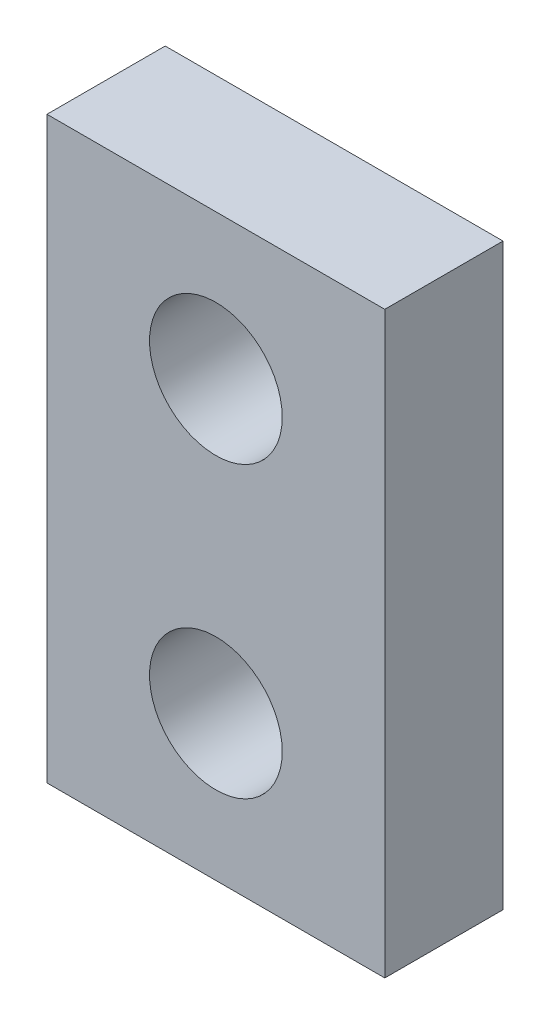
ISO-10303-21;
HEADER;
FILE_DESCRIPTION(('STEP AP214'),'2;1');
FILE_NAME('part.step','',(''),(''),'','','');
FILE_SCHEMA(('AUTOMOTIVE_DESIGN { 1 0 10303 214 1 1 1 1 }'));
ENDSEC;
DATA;
#1=APPLICATION_CONTEXT('core data for automotive mechanical design processes');
#2=APPLICATION_PROTOCOL_DEFINITION('international standard','automotive_design',2000,#1);
#3=PRODUCT_CONTEXT('',#1,'mechanical');
#4=PRODUCT('Part','Part','',(#3));
#5=PRODUCT_RELATED_PRODUCT_CATEGORY('part','',(#4));
#6=PRODUCT_DEFINITION_FORMATION('','',#4);
#7=PRODUCT_DEFINITION_CONTEXT('part definition',#1,'design');
#8=PRODUCT_DEFINITION('design','',#6,#7);
#9=PRODUCT_DEFINITION_SHAPE('','',#8);
#10=(LENGTH_UNIT() NAMED_UNIT(*) SI_UNIT(.MILLI.,.METRE.));
#11=(NAMED_UNIT(*) PLANE_ANGLE_UNIT() SI_UNIT($,.RADIAN.));
#12=(NAMED_UNIT(*) SI_UNIT($,.STERADIAN.) SOLID_ANGLE_UNIT());
#13=UNCERTAINTY_MEASURE_WITH_UNIT(LENGTH_MEASURE(1.E-05),#10,'distance_accuracy_value','');
#14=(GEOMETRIC_REPRESENTATION_CONTEXT(3) GLOBAL_UNCERTAINTY_ASSIGNED_CONTEXT((#13)) GLOBAL_UNIT_ASSIGNED_CONTEXT((#10,
#11,#12)) REPRESENTATION_CONTEXT('',''));
#15=CARTESIAN_POINT('',(0.,0.,0.));
#16=DIRECTION('',(0.,0.,1.));
#17=DIRECTION('',(1.,0.,0.));
#18=AXIS2_PLACEMENT_3D('',#15,#16,#17);
#19=CARTESIAN_POINT('',(0.,0.,2.45));
#20=DIRECTION('',(0.,0.,-1.));
#21=DIRECTION('',(-1.,0.,0.));
#22=AXIS2_PLACEMENT_3D('',#19,#20,#21);
#23=PLANE('',#22);
#24=DIRECTION('',(0.,-1.,0.));
#25=VECTOR('',#24,1.);
#26=CARTESIAN_POINT('',(0.,0.,2.45));
#27=LINE('',#26,#25);
#28=CARTESIAN_POINT('',(0.,12.,2.45));
#29=VERTEX_POINT('',#28);
#30=CARTESIAN_POINT('',(0.,0.,2.45));
#31=VERTEX_POINT('',#30);
#32=EDGE_CURVE('E89',#29,#31,#27,.T.);
#33=ORIENTED_EDGE('',*,*,#32,.T.);
#34=DIRECTION('',(1.,0.,0.));
#35=VECTOR('',#34,1.);
#36=CARTESIAN_POINT('',(0.,0.,2.45));
#37=LINE('',#36,#35);
#38=CARTESIAN_POINT('',(7.,0.,2.45));
#39=VERTEX_POINT('',#38);
#40=EDGE_CURVE('E84',#31,#39,#37,.T.);
#41=ORIENTED_EDGE('',*,*,#40,.T.);
#42=DIRECTION('',(0.,1.,0.));
#43=VECTOR('',#42,1.);
#44=CARTESIAN_POINT('',(7.,0.,2.45));
#45=LINE('',#44,#43);
#46=CARTESIAN_POINT('',(7.,12.,2.45));
#47=VERTEX_POINT('',#46);
#48=EDGE_CURVE('E87',#39,#47,#45,.T.);
#49=ORIENTED_EDGE('',*,*,#48,.T.);
#50=DIRECTION('',(-1.,0.,0.));
#51=VECTOR('',#50,1.);
#52=CARTESIAN_POINT('',(0.,12.,2.45));
#53=LINE('',#52,#51);
#54=EDGE_CURVE('E54',#47,#29,#53,.T.);
#55=ORIENTED_EDGE('',*,*,#54,.T.);
#56=EDGE_LOOP('',(#33,#41,#49,#55));
#57=FACE_BOUND('',#56,.T.);
#58=CARTESIAN_POINT('',(3.5,3.,2.45));
#59=DIRECTION('',(0.,0.,1.));
#60=DIRECTION('',(1.,0.,0.));
#61=AXIS2_PLACEMENT_3D('',#58,#59,#60);
#62=CIRCLE('',#61,1.375);
#63=CARTESIAN_POINT('',(4.875,3.,2.45));
#64=VERTEX_POINT('',#63);
#65=EDGE_CURVE('E110',#64,#64,#62,.T.);
#66=ORIENTED_EDGE('',*,*,#65,.F.);
#67=EDGE_LOOP('',(#66));
#68=FACE_BOUND('',#67,.T.);
#69=CARTESIAN_POINT('',(3.5,9.,2.45));
#70=DIRECTION('',(0.,0.,1.));
#71=DIRECTION('',(1.,0.,0.));
#72=AXIS2_PLACEMENT_3D('',#69,#70,#71);
#73=CIRCLE('',#72,1.375);
#74=CARTESIAN_POINT('',(4.875,9.,2.45));
#75=VERTEX_POINT('',#74);
#76=EDGE_CURVE('E134',#75,#75,#73,.T.);
#77=ORIENTED_EDGE('',*,*,#76,.F.);
#78=EDGE_LOOP('',(#77));
#79=FACE_BOUND('',#78,.T.);
#80=ADVANCED_FACE('F36',(#57,#68,#79),#23,.F.);
#81=CARTESIAN_POINT('',(0.,0.,0.));
#82=DIRECTION('',(0.,0.,-1.));
#83=DIRECTION('',(-1.,0.,0.));
#84=AXIS2_PLACEMENT_3D('',#81,#82,#83);
#85=PLANE('',#84);
#86=CARTESIAN_POINT('',(3.5,3.,0.));
#87=DIRECTION('',(0.,0.,1.));
#88=DIRECTION('',(1.,0.,0.));
#89=AXIS2_PLACEMENT_3D('',#86,#87,#88);
#90=CIRCLE('',#89,1.375);
#91=CARTESIAN_POINT('',(4.875,3.,0.));
#92=VERTEX_POINT('',#91);
#93=EDGE_CURVE('E130',#92,#92,#90,.T.);
#94=ORIENTED_EDGE('',*,*,#93,.T.);
#95=EDGE_LOOP('',(#94));
#96=FACE_BOUND('',#95,.T.);
#97=DIRECTION('',(0.,-1.,0.));
#98=VECTOR('',#97,1.);
#99=CARTESIAN_POINT('',(0.,0.,0.));
#100=LINE('',#99,#98);
#101=CARTESIAN_POINT('',(0.,12.,0.));
#102=VERTEX_POINT('',#101);
#103=CARTESIAN_POINT('',(0.,0.,0.));
#104=VERTEX_POINT('',#103);
#105=EDGE_CURVE('E106',#102,#104,#100,.T.);
#106=ORIENTED_EDGE('',*,*,#105,.F.);
#107=DIRECTION('',(-1.,0.,0.));
#108=VECTOR('',#107,1.);
#109=CARTESIAN_POINT('',(0.,12.,0.));
#110=LINE('',#109,#108);
#111=CARTESIAN_POINT('',(7.,12.,0.));
#112=VERTEX_POINT('',#111);
#113=EDGE_CURVE('E77',#112,#102,#110,.T.);
#114=ORIENTED_EDGE('',*,*,#113,.F.);
#115=DIRECTION('',(0.,1.,0.));
#116=VECTOR('',#115,1.);
#117=CARTESIAN_POINT('',(7.,0.,0.));
#118=LINE('',#117,#116);
#119=CARTESIAN_POINT('',(7.,0.,0.));
#120=VERTEX_POINT('',#119);
#121=EDGE_CURVE('E71',#120,#112,#118,.T.);
#122=ORIENTED_EDGE('',*,*,#121,.F.);
#123=DIRECTION('',(1.,0.,0.));
#124=VECTOR('',#123,1.);
#125=CARTESIAN_POINT('',(0.,0.,0.));
#126=LINE('',#125,#124);
#127=EDGE_CURVE('E94',#104,#120,#126,.T.);
#128=ORIENTED_EDGE('',*,*,#127,.F.);
#129=EDGE_LOOP('',(#106,#114,#122,#128));
#130=FACE_BOUND('',#129,.T.);
#131=CARTESIAN_POINT('',(3.5,9.,0.));
#132=DIRECTION('',(0.,0.,1.));
#133=DIRECTION('',(1.,0.,0.));
#134=AXIS2_PLACEMENT_3D('',#131,#132,#133);
#135=CIRCLE('',#134,1.375);
#136=CARTESIAN_POINT('',(4.875,9.,0.));
#137=VERTEX_POINT('',#136);
#138=EDGE_CURVE('E138',#137,#137,#135,.T.);
#139=ORIENTED_EDGE('',*,*,#138,.T.);
#140=EDGE_LOOP('',(#139));
#141=FACE_BOUND('',#140,.T.);
#142=ADVANCED_FACE('F124',(#96,#130,#141),#85,.T.);
#143=CARTESIAN_POINT('',(0.,0.,2.45));
#144=DIRECTION('',(1.,0.,0.));
#145=DIRECTION('',(0.,0.,-1.));
#146=AXIS2_PLACEMENT_3D('',#143,#144,#145);
#147=PLANE('',#146);
#148=ORIENTED_EDGE('',*,*,#105,.T.);
#149=DIRECTION('',(0.,0.,-1.));
#150=VECTOR('',#149,1.);
#151=CARTESIAN_POINT('',(0.,0.,2.45));
#152=LINE('',#151,#150);
#153=EDGE_CURVE('E11',#31,#104,#152,.T.);
#154=ORIENTED_EDGE('',*,*,#153,.F.);
#155=ORIENTED_EDGE('',*,*,#32,.F.);
#156=DIRECTION('',(0.,0.,-1.));
#157=VECTOR('',#156,1.);
#158=CARTESIAN_POINT('',(0.,12.,2.45));
#159=LINE('',#158,#157);
#160=EDGE_CURVE('E102',#29,#102,#159,.T.);
#161=ORIENTED_EDGE('',*,*,#160,.T.);
#162=EDGE_LOOP('',(#148,#154,#155,#161));
#163=FACE_BOUND('',#162,.T.);
#164=ADVANCED_FACE('F38',(#163),#147,.F.);
#165=CARTESIAN_POINT('',(0.,0.,2.45));
#166=DIRECTION('',(0.,1.,0.));
#167=DIRECTION('',(0.,0.,1.));
#168=AXIS2_PLACEMENT_3D('',#165,#166,#167);
#169=PLANE('',#168);
#170=ORIENTED_EDGE('',*,*,#127,.T.);
#171=DIRECTION('',(0.,0.,-1.));
#172=VECTOR('',#171,1.);
#173=CARTESIAN_POINT('',(7.,0.,2.45));
#174=LINE('',#173,#172);
#175=EDGE_CURVE('E46',#39,#120,#174,.T.);
#176=ORIENTED_EDGE('',*,*,#175,.F.);
#177=ORIENTED_EDGE('',*,*,#40,.F.);
#178=ORIENTED_EDGE('',*,*,#153,.T.);
#179=EDGE_LOOP('',(#170,#176,#177,#178));
#180=FACE_BOUND('',#179,.T.);
#181=ADVANCED_FACE('F93',(#180),#169,.F.);
#182=CARTESIAN_POINT('',(7.,0.,2.45));
#183=DIRECTION('',(-1.,0.,0.));
#184=DIRECTION('',(0.,0.,1.));
#185=AXIS2_PLACEMENT_3D('',#182,#183,#184);
#186=PLANE('',#185);
#187=ORIENTED_EDGE('',*,*,#121,.T.);
#188=DIRECTION('',(0.,0.,-1.));
#189=VECTOR('',#188,1.);
#190=CARTESIAN_POINT('',(7.,12.,2.45));
#191=LINE('',#190,#189);
#192=EDGE_CURVE('E96',#47,#112,#191,.T.);
#193=ORIENTED_EDGE('',*,*,#192,.F.);
#194=ORIENTED_EDGE('',*,*,#48,.F.);
#195=ORIENTED_EDGE('',*,*,#175,.T.);
#196=EDGE_LOOP('',(#187,#193,#194,#195));
#197=FACE_BOUND('',#196,.T.);
#198=ADVANCED_FACE('F97',(#197),#186,.F.);
#199=CARTESIAN_POINT('',(0.,12.,2.45));
#200=DIRECTION('',(0.,-1.,0.));
#201=DIRECTION('',(0.,0.,-1.));
#202=AXIS2_PLACEMENT_3D('',#199,#200,#201);
#203=PLANE('',#202);
#204=ORIENTED_EDGE('',*,*,#113,.T.);
#205=ORIENTED_EDGE('',*,*,#160,.F.);
#206=ORIENTED_EDGE('',*,*,#54,.F.);
#207=ORIENTED_EDGE('',*,*,#192,.T.);
#208=EDGE_LOOP('',(#204,#205,#206,#207));
#209=FACE_BOUND('',#208,.T.);
#210=ADVANCED_FACE('F121',(#209),#203,.F.);
#211=CARTESIAN_POINT('',(3.5,3.,2.45));
#212=DIRECTION('',(0.,0.,-1.));
#213=DIRECTION('',(-1.,0.,0.));
#214=AXIS2_PLACEMENT_3D('',#211,#212,#213);
#215=CYLINDRICAL_SURFACE('',#214,1.375);
#216=ORIENTED_EDGE('',*,*,#65,.T.);
#217=EDGE_LOOP('',(#216));
#218=FACE_BOUND('',#217,.T.);
#219=ORIENTED_EDGE('',*,*,#93,.F.);
#220=EDGE_LOOP('',(#219));
#221=FACE_BOUND('',#220,.T.);
#222=ADVANCED_FACE('F158',(#218,#221),#215,.F.);
#223=CARTESIAN_POINT('',(3.5,9.,2.45));
#224=DIRECTION('',(0.,0.,-1.));
#225=DIRECTION('',(-1.,0.,0.));
#226=AXIS2_PLACEMENT_3D('',#223,#224,#225);
#227=CYLINDRICAL_SURFACE('',#226,1.375);
#228=ORIENTED_EDGE('',*,*,#76,.T.);
#229=EDGE_LOOP('',(#228));
#230=FACE_BOUND('',#229,.T.);
#231=ORIENTED_EDGE('',*,*,#138,.F.);
#232=EDGE_LOOP('',(#231));
#233=FACE_BOUND('',#232,.T.);
#234=ADVANCED_FACE('F147',(#230,#233),#227,.F.);
#235=CLOSED_SHELL('',(#80,#142,#164,#181,#198,#210,#222,#234));
#236=MANIFOLD_SOLID_BREP('B2',#235);
#237=ADVANCED_BREP_SHAPE_REPRESENTATION('',(#18,#236),#14);
#238=SHAPE_DEFINITION_REPRESENTATION(#9,#237);
ENDSEC;
END-ISO-10303-21;
